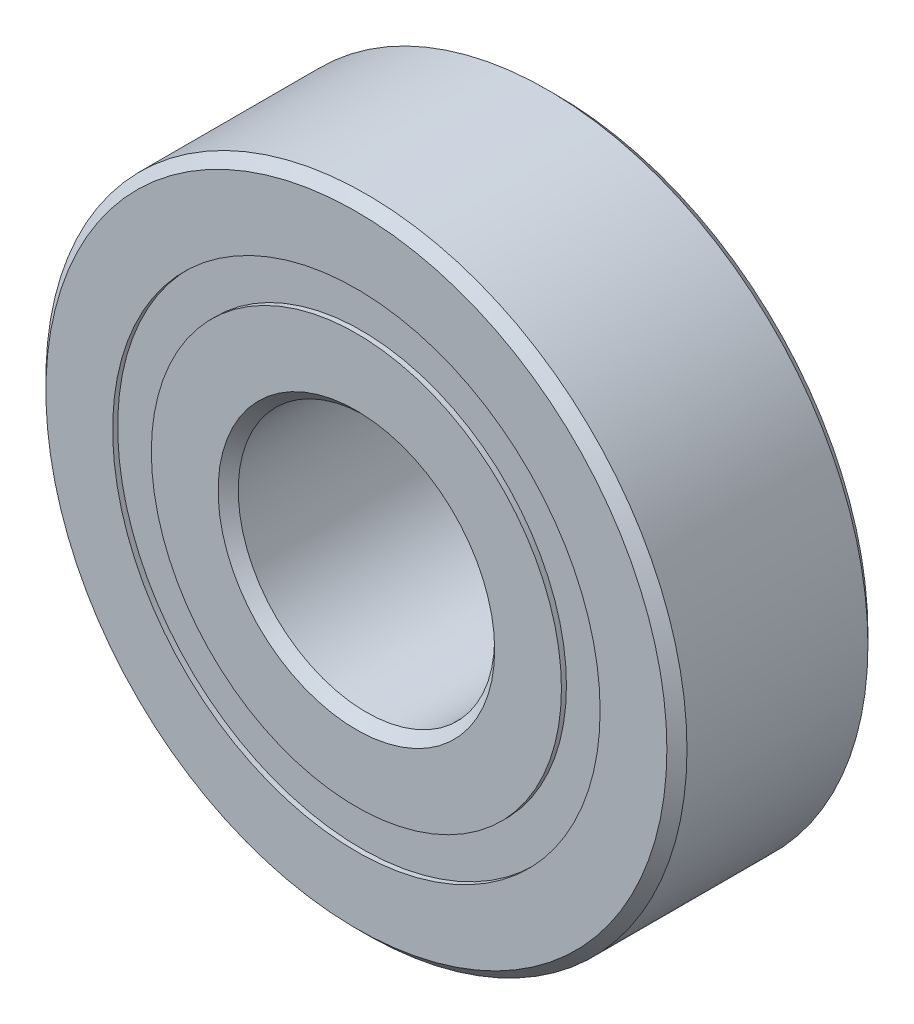
ISO-10303-21;
HEADER;
FILE_DESCRIPTION(('STEP AP214'),'2;1');
FILE_NAME('part.step','',(''),(''),'','','');
FILE_SCHEMA(('AUTOMOTIVE_DESIGN { 1 0 10303 214 1 1 1 1 }'));
ENDSEC;
DATA;
#1=APPLICATION_CONTEXT('core data for automotive mechanical design processes');
#2=APPLICATION_PROTOCOL_DEFINITION('international standard','automotive_design',2000,#1);
#3=PRODUCT_CONTEXT('',#1,'mechanical');
#4=PRODUCT('Part','Part','',(#3));
#5=PRODUCT_RELATED_PRODUCT_CATEGORY('part','',(#4));
#6=PRODUCT_DEFINITION_FORMATION('','',#4);
#7=PRODUCT_DEFINITION_CONTEXT('part definition',#1,'design');
#8=PRODUCT_DEFINITION('design','',#6,#7);
#9=PRODUCT_DEFINITION_SHAPE('','',#8);
#10=(LENGTH_UNIT() NAMED_UNIT(*) SI_UNIT(.MILLI.,.METRE.));
#11=(NAMED_UNIT(*) PLANE_ANGLE_UNIT() SI_UNIT($,.RADIAN.));
#12=(NAMED_UNIT(*) SI_UNIT($,.STERADIAN.) SOLID_ANGLE_UNIT());
#13=UNCERTAINTY_MEASURE_WITH_UNIT(LENGTH_MEASURE(1.E-05),#10,'distance_accuracy_value','');
#14=(GEOMETRIC_REPRESENTATION_CONTEXT(3) GLOBAL_UNCERTAINTY_ASSIGNED_CONTEXT((#13)) GLOBAL_UNIT_ASSIGNED_CONTEXT((#10,
#11,#12)) REPRESENTATION_CONTEXT('',''));
#15=CARTESIAN_POINT('',(0.,0.,0.));
#16=DIRECTION('',(0.,0.,1.));
#17=DIRECTION('',(1.,0.,0.));
#18=AXIS2_PLACEMENT_3D('',#15,#16,#17);
#19=CARTESIAN_POINT('',(0.,6.03522142857143,-2.36474));
#20=DIRECTION('',(0.,0.,1.));
#21=DIRECTION('',(1.,0.,0.));
#22=AXIS2_PLACEMENT_3D('',#19,#20,#21);
#23=PLANE('',#22);
#24=CARTESIAN_POINT('',(0.,0.,-2.36474));
#25=DIRECTION('',(0.,0.,1.));
#26=DIRECTION('',(1.,0.,0.));
#27=AXIS2_PLACEMENT_3D('',#24,#25,#26);
#28=CIRCLE('',#27,6.03522142857143);
#29=CARTESIAN_POINT('',(6.03522142857143,0.,-2.36474));
#30=VERTEX_POINT('',#29);
#31=EDGE_CURVE('E72',#30,#30,#28,.T.);
#32=ORIENTED_EDGE('',*,*,#31,.F.);
#33=EDGE_LOOP('',(#32));
#34=FACE_BOUND('',#33,.T.);
#35=CARTESIAN_POINT('',(0.,0.,-2.36474));
#36=DIRECTION('',(0.,0.,1.));
#37=DIRECTION('',(1.,0.,0.));
#38=AXIS2_PLACEMENT_3D('',#35,#36,#37);
#39=CIRCLE('',#38,5.07727857142857);
#40=CARTESIAN_POINT('',(5.07727857142857,0.,-2.36474));
#41=VERTEX_POINT('',#40);
#42=EDGE_CURVE('E11',#41,#41,#39,.T.);
#43=ORIENTED_EDGE('',*,*,#42,.T.);
#44=EDGE_LOOP('',(#43));
#45=FACE_BOUND('',#44,.T.);
#46=ADVANCED_FACE('F58',(#34,#45),#23,.F.);
#47=CARTESIAN_POINT('',(0.,0.,2.4892));
#48=DIRECTION('',(0.,0.,1.));
#49=DIRECTION('',(1.,0.,0.));
#50=AXIS2_PLACEMENT_3D('',#47,#48,#49);
#51=CYLINDRICAL_SURFACE('',#50,5.07727857142857);
#52=ORIENTED_EDGE('',*,*,#42,.F.);
#53=EDGE_LOOP('',(#52));
#54=FACE_BOUND('',#53,.T.);
#55=CARTESIAN_POINT('',(0.,0.,-1.20554465033679));
#56=DIRECTION('',(0.,0.,1.));
#57=DIRECTION('',(1.,0.,0.));
#58=AXIS2_PLACEMENT_3D('',#55,#56,#57);
#59=CIRCLE('',#58,5.07727857142857);
#60=CARTESIAN_POINT('',(5.07727857142857,0.,-1.20554465033679));
#61=VERTEX_POINT('',#60);
#62=EDGE_CURVE('E64',#61,#61,#59,.T.);
#63=ORIENTED_EDGE('',*,*,#62,.T.);
#64=EDGE_LOOP('',(#63));
#65=FACE_BOUND('',#64,.T.);
#66=ADVANCED_FACE('F81',(#54,#65),#51,.F.);
#67=CARTESIAN_POINT('',(0.,6.03522142857143,-1.20554465033679));
#68=DIRECTION('',(0.,0.,-1.));
#69=DIRECTION('',(-1.,0.,0.));
#70=AXIS2_PLACEMENT_3D('',#67,#68,#69);
#71=PLANE('',#70);
#72=ORIENTED_EDGE('',*,*,#62,.F.);
#73=EDGE_LOOP('',(#72));
#74=FACE_BOUND('',#73,.T.);
#75=CARTESIAN_POINT('',(0.,0.,-1.20554465033679));
#76=DIRECTION('',(0.,0.,1.));
#77=DIRECTION('',(1.,0.,0.));
#78=AXIS2_PLACEMENT_3D('',#75,#76,#77);
#79=CIRCLE('',#78,6.03522142857143);
#80=CARTESIAN_POINT('',(6.03522142857143,0.,-1.20554465033679));
#81=VERTEX_POINT('',#80);
#82=EDGE_CURVE('E68',#81,#81,#79,.T.);
#83=ORIENTED_EDGE('',*,*,#82,.T.);
#84=EDGE_LOOP('',(#83));
#85=FACE_BOUND('',#84,.T.);
#86=ADVANCED_FACE('F85',(#74,#85),#71,.F.);
#87=CARTESIAN_POINT('',(0.,0.,2.4892));
#88=DIRECTION('',(0.,0.,1.));
#89=DIRECTION('',(1.,0.,0.));
#90=AXIS2_PLACEMENT_3D('',#87,#88,#89);
#91=CYLINDRICAL_SURFACE('',#90,6.03522142857143);
#92=ORIENTED_EDGE('',*,*,#82,.F.);
#93=EDGE_LOOP('',(#92));
#94=FACE_BOUND('',#93,.T.);
#95=ORIENTED_EDGE('',*,*,#31,.T.);
#96=EDGE_LOOP('',(#95));
#97=FACE_BOUND('',#96,.T.);
#98=ADVANCED_FACE('F78',(#94,#97),#91,.T.);
#99=CLOSED_SHELL('',(#46,#66,#86,#98));
#100=MANIFOLD_SOLID_BREP('B2',#99);
#101=CARTESIAN_POINT('',(0.,6.03522142857143,2.36474));
#102=DIRECTION('',(0.,0.,-1.));
#103=DIRECTION('',(-1.,0.,0.));
#104=AXIS2_PLACEMENT_3D('',#101,#102,#103);
#105=PLANE('',#104);
#106=CARTESIAN_POINT('',(0.,0.,2.36474));
#107=DIRECTION('',(0.,0.,1.));
#108=DIRECTION('',(1.,0.,0.));
#109=AXIS2_PLACEMENT_3D('',#106,#107,#108);
#110=CIRCLE('',#109,5.07727857142857);
#111=CARTESIAN_POINT('',(5.07727857142857,0.,2.36474));
#112=VERTEX_POINT('',#111);
#113=EDGE_CURVE('E57',#112,#112,#110,.T.);
#114=ORIENTED_EDGE('',*,*,#113,.F.);
#115=EDGE_LOOP('',(#114));
#116=FACE_BOUND('',#115,.T.);
#117=CARTESIAN_POINT('',(0.,0.,2.36474));
#118=DIRECTION('',(0.,0.,1.));
#119=DIRECTION('',(1.,0.,0.));
#120=AXIS2_PLACEMENT_3D('',#117,#118,#119);
#121=CIRCLE('',#120,6.03522142857143);
#122=CARTESIAN_POINT('',(6.03522142857143,0.,2.36474));
#123=VERTEX_POINT('',#122);
#124=EDGE_CURVE('E159',#123,#123,#121,.T.);
#125=ORIENTED_EDGE('',*,*,#124,.T.);
#126=EDGE_LOOP('',(#125));
#127=FACE_BOUND('',#126,.T.);
#128=ADVANCED_FACE('F145',(#116,#127),#105,.F.);
#129=CARTESIAN_POINT('',(0.,0.,2.4892));
#130=DIRECTION('',(0.,0.,1.));
#131=DIRECTION('',(1.,0.,0.));
#132=AXIS2_PLACEMENT_3D('',#129,#130,#131);
#133=CYLINDRICAL_SURFACE('',#132,5.07727857142857);
#134=CARTESIAN_POINT('',(0.,0.,1.20554465033679));
#135=DIRECTION('',(0.,0.,1.));
#136=DIRECTION('',(1.,0.,0.));
#137=AXIS2_PLACEMENT_3D('',#134,#135,#136);
#138=CIRCLE('',#137,5.07727857142857);
#139=CARTESIAN_POINT('',(5.07727857142857,0.,1.20554465033679));
#140=VERTEX_POINT('',#139);
#141=EDGE_CURVE('E151',#140,#140,#138,.T.);
#142=ORIENTED_EDGE('',*,*,#141,.F.);
#143=EDGE_LOOP('',(#142));
#144=FACE_BOUND('',#143,.T.);
#145=ORIENTED_EDGE('',*,*,#113,.T.);
#146=EDGE_LOOP('',(#145));
#147=FACE_BOUND('',#146,.T.);
#148=ADVANCED_FACE('F174',(#144,#147),#133,.F.);
#149=CARTESIAN_POINT('',(0.,6.03522142857143,1.20554465033679));
#150=DIRECTION('',(0.,0.,1.));
#151=DIRECTION('',(1.,0.,0.));
#152=AXIS2_PLACEMENT_3D('',#149,#150,#151);
#153=PLANE('',#152);
#154=CARTESIAN_POINT('',(0.,0.,1.20554465033679));
#155=DIRECTION('',(0.,0.,1.));
#156=DIRECTION('',(1.,0.,0.));
#157=AXIS2_PLACEMENT_3D('',#154,#155,#156);
#158=CIRCLE('',#157,6.03522142857143);
#159=CARTESIAN_POINT('',(6.03522142857143,0.,1.20554465033679));
#160=VERTEX_POINT('',#159);
#161=EDGE_CURVE('E155',#160,#160,#158,.T.);
#162=ORIENTED_EDGE('',*,*,#161,.F.);
#163=EDGE_LOOP('',(#162));
#164=FACE_BOUND('',#163,.T.);
#165=ORIENTED_EDGE('',*,*,#141,.T.);
#166=EDGE_LOOP('',(#165));
#167=FACE_BOUND('',#166,.T.);
#168=ADVANCED_FACE('F169',(#164,#167),#153,.F.);
#169=CARTESIAN_POINT('',(0.,0.,2.4892));
#170=DIRECTION('',(0.,0.,1.));
#171=DIRECTION('',(1.,0.,0.));
#172=AXIS2_PLACEMENT_3D('',#169,#170,#171);
#173=CYLINDRICAL_SURFACE('',#172,6.03522142857143);
#174=ORIENTED_EDGE('',*,*,#124,.F.);
#175=EDGE_LOOP('',(#174));
#176=FACE_BOUND('',#175,.T.);
#177=ORIENTED_EDGE('',*,*,#161,.T.);
#178=EDGE_LOOP('',(#177));
#179=FACE_BOUND('',#178,.T.);
#180=ADVANCED_FACE('F166',(#176,#179),#173,.T.);
#181=CLOSED_SHELL('',(#128,#148,#168,#180));
#182=MANIFOLD_SOLID_BREP('B6',#181);
#183=CARTESIAN_POINT('',(-3.26588180805,4.49510067499584,0.));
#184=DIRECTION('',(0.,0.,1.));
#185=DIRECTION('',(-0.587785252292462,0.809016994374955,0.));
#186=AXIS2_PLACEMENT_3D('',#183,#184,#185);
#187=SPHERICAL_SURFACE('',#186,1.20554465033679);
#188=CARTESIAN_POINT('',(-3.26588180805,4.49510067499584,1.20554465033679));
#189=VERTEX_POINT('',#188);
#190=VERTEX_LOOP('',#189);
#191=FACE_BOUND('',#190,.T.);
#192=ADVANCED_FACE('F232',(#191),#187,.T.);
#193=CLOSED_SHELL('',(#192));
#194=MANIFOLD_SOLID_BREP('B52',#193);
#195=CARTESIAN_POINT('',(-5.28430776866493,1.71697567499586,0.));
#196=DIRECTION('',(0.,0.,1.));
#197=DIRECTION('',(-0.95105651629515,0.309016994374958,0.));
#198=AXIS2_PLACEMENT_3D('',#195,#196,#197);
#199=SPHERICAL_SURFACE('',#198,1.20554465033679);
#200=CARTESIAN_POINT('',(-5.28430776866493,1.71697567499586,1.20554465033679));
#201=VERTEX_POINT('',#200);
#202=VERTEX_LOOP('',#201);
#203=FACE_BOUND('',#202,.T.);
#204=ADVANCED_FACE('F255',(#203),#199,.T.);
#205=CLOSED_SHELL('',(#204));
#206=MANIFOLD_SOLID_BREP('B141',#205);
#207=CARTESIAN_POINT('',(-5.28430776866496,-1.71697567499575,0.));
#208=DIRECTION('',(0.,0.,1.));
#209=DIRECTION('',(-0.951056516295157,-0.309016994374938,0.));
#210=AXIS2_PLACEMENT_3D('',#207,#208,#209);
#211=SPHERICAL_SURFACE('',#210,1.20554465033679);
#212=CARTESIAN_POINT('',(-5.28430776866496,-1.71697567499575,1.20554465033679));
#213=VERTEX_POINT('',#212);
#214=VERTEX_LOOP('',#213);
#215=FACE_BOUND('',#214,.T.);
#216=ADVANCED_FACE('F278',(#215),#211,.T.);
#217=CLOSED_SHELL('',(#216));
#218=MANIFOLD_SOLID_BREP('B228',#217);
#219=CARTESIAN_POINT('',(-3.26588180805009,-4.49510067499577,0.));
#220=DIRECTION('',(0.,0.,1.));
#221=DIRECTION('',(-0.58778525229248,-0.809016994374942,0.));
#222=AXIS2_PLACEMENT_3D('',#219,#220,#221);
#223=SPHERICAL_SURFACE('',#222,1.20554465033679);
#224=CARTESIAN_POINT('',(-3.26588180805009,-4.49510067499577,1.20554465033679));
#225=VERTEX_POINT('',#224);
#226=VERTEX_LOOP('',#225);
#227=FACE_BOUND('',#226,.T.);
#228=ADVANCED_FACE('F301',(#227),#223,.T.);
#229=CLOSED_SHELL('',(#228));
#230=MANIFOLD_SOLID_BREP('B251',#229);
#231=CARTESIAN_POINT('',(0.,-5.55625,0.));
#232=DIRECTION('',(0.,0.,1.));
#233=DIRECTION('',(0.,-1.,0.));
#234=AXIS2_PLACEMENT_3D('',#231,#232,#233);
#235=SPHERICAL_SURFACE('',#234,1.20554465033679);
#236=CARTESIAN_POINT('',(0.,-5.55625,1.20554465033679));
#237=VERTEX_POINT('',#236);
#238=VERTEX_LOOP('',#237);
#239=FACE_BOUND('',#238,.T.);
#240=ADVANCED_FACE('F324',(#239),#235,.T.);
#241=CLOSED_SHELL('',(#240));
#242=MANIFOLD_SOLID_BREP('B274',#241);
#243=CARTESIAN_POINT('',(3.26588180805003,-4.49510067499582,0.));
#244=DIRECTION('',(0.,0.,1.));
#245=DIRECTION('',(0.587785252292469,-0.809016994374951,0.));
#246=AXIS2_PLACEMENT_3D('',#243,#244,#245);
#247=SPHERICAL_SURFACE('',#246,1.20554465033679);
#248=CARTESIAN_POINT('',(3.26588180805003,-4.49510067499582,1.20554465033679));
#249=VERTEX_POINT('',#248);
#250=VERTEX_LOOP('',#249);
#251=FACE_BOUND('',#250,.T.);
#252=ADVANCED_FACE('F347',(#251),#247,.T.);
#253=CLOSED_SHELL('',(#252));
#254=MANIFOLD_SOLID_BREP('B297',#253);
#255=CARTESIAN_POINT('',(5.28430776866494,-1.71697567499582,0.));
#256=DIRECTION('',(0.,0.,1.));
#257=DIRECTION('',(0.951056516295152,-0.309016994374952,0.));
#258=AXIS2_PLACEMENT_3D('',#255,#256,#257);
#259=SPHERICAL_SURFACE('',#258,1.20554465033679);
#260=CARTESIAN_POINT('',(5.28430776866494,-1.71697567499582,1.20554465033679));
#261=VERTEX_POINT('',#260);
#262=VERTEX_LOOP('',#261);
#263=FACE_BOUND('',#262,.T.);
#264=ADVANCED_FACE('F370',(#263),#259,.T.);
#265=CLOSED_SHELL('',(#264));
#266=MANIFOLD_SOLID_BREP('B320',#265);
#267=CARTESIAN_POINT('',(5.28430776866495,1.71697567499579,0.));
#268=DIRECTION('',(0.,0.,1.));
#269=DIRECTION('',(0.951056516295155,0.309016994374945,0.));
#270=AXIS2_PLACEMENT_3D('',#267,#268,#269);
#271=SPHERICAL_SURFACE('',#270,1.20554465033679);
#272=CARTESIAN_POINT('',(5.28430776866495,1.71697567499579,1.20554465033679));
#273=VERTEX_POINT('',#272);
#274=VERTEX_LOOP('',#273);
#275=FACE_BOUND('',#274,.T.);
#276=ADVANCED_FACE('F393',(#275),#271,.T.);
#277=CLOSED_SHELL('',(#276));
#278=MANIFOLD_SOLID_BREP('B343',#277);
#279=CARTESIAN_POINT('',(3.26588180805006,4.4951006749958,0.));
#280=DIRECTION('',(0.,0.,1.));
#281=DIRECTION('',(0.587785252292474,0.809016994374947,0.));
#282=AXIS2_PLACEMENT_3D('',#279,#280,#281);
#283=SPHERICAL_SURFACE('',#282,1.20554465033679);
#284=CARTESIAN_POINT('',(3.26588180805006,4.4951006749958,1.20554465033679));
#285=VERTEX_POINT('',#284);
#286=VERTEX_LOOP('',#285);
#287=FACE_BOUND('',#286,.T.);
#288=ADVANCED_FACE('F416',(#287),#283,.T.);
#289=CLOSED_SHELL('',(#288));
#290=MANIFOLD_SOLID_BREP('B366',#289);
#291=CARTESIAN_POINT('',(0.,5.55625,0.));
#292=DIRECTION('',(0.,0.,1.));
#293=DIRECTION('',(0.,1.,0.));
#294=AXIS2_PLACEMENT_3D('',#291,#292,#293);
#295=SPHERICAL_SURFACE('',#294,1.20554465033679);
#296=CARTESIAN_POINT('',(0.,5.55625,1.20554465033679));
#297=VERTEX_POINT('',#296);
#298=VERTEX_LOOP('',#297);
#299=FACE_BOUND('',#298,.T.);
#300=ADVANCED_FACE('F441',(#299),#295,.T.);
#301=CLOSED_SHELL('',(#300));
#302=MANIFOLD_SOLID_BREP('B389',#301);
#303=CARTESIAN_POINT('',(0.,5.07727857142857,2.4892));
#304=DIRECTION('',(0.,0.,-1.));
#305=DIRECTION('',(-1.,0.,0.));
#306=AXIS2_PLACEMENT_3D('',#303,#304,#305);
#307=PLANE('',#306);
#308=CARTESIAN_POINT('',(0.,0.,2.4892));
#309=DIRECTION('',(0.,0.,1.));
#310=DIRECTION('',(1.,0.,0.));
#311=AXIS2_PLACEMENT_3D('',#308,#309,#310);
#312=CIRCLE('',#311,3.42392);
#313=CARTESIAN_POINT('',(3.42392,0.,2.4892));
#314=VERTEX_POINT('',#313);
#315=EDGE_CURVE('E487',#314,#314,#312,.T.);
#316=ORIENTED_EDGE('',*,*,#315,.F.);
#317=EDGE_LOOP('',(#316));
#318=FACE_BOUND('',#317,.T.);
#319=CARTESIAN_POINT('',(0.,0.,2.4892));
#320=DIRECTION('',(0.,0.,1.));
#321=DIRECTION('',(1.,0.,0.));
#322=AXIS2_PLACEMENT_3D('',#319,#320,#321);
#323=CIRCLE('',#322,5.07727857142857);
#324=CARTESIAN_POINT('',(5.07727857142857,0.,2.4892));
#325=VERTEX_POINT('',#324);
#326=EDGE_CURVE('E440',#325,#325,#323,.T.);
#327=ORIENTED_EDGE('',*,*,#326,.T.);
#328=EDGE_LOOP('',(#327));
#329=FACE_BOUND('',#328,.T.);
#330=ADVANCED_FACE('F459',(#318,#329),#307,.F.);
#331=CARTESIAN_POINT('',(0.,0.,2.4892));
#332=DIRECTION('',(0.,0.,1.));
#333=DIRECTION('',(1.,0.,0.));
#334=AXIS2_PLACEMENT_3D('',#331,#332,#333);
#335=CYLINDRICAL_SURFACE('',#334,5.07727857142857);
#336=ORIENTED_EDGE('',*,*,#326,.F.);
#337=EDGE_LOOP('',(#336));
#338=FACE_BOUND('',#337,.T.);
#339=CARTESIAN_POINT('',(0.,0.,1.10631111111111));
#340=DIRECTION('',(0.,0.,1.));
#341=DIRECTION('',(1.,0.,0.));
#342=AXIS2_PLACEMENT_3D('',#339,#340,#341);
#343=CIRCLE('',#342,5.07727857142857);
#344=CARTESIAN_POINT('',(5.07727857142857,0.,1.10631111111111));
#345=VERTEX_POINT('',#344);
#346=EDGE_CURVE('E465',#345,#345,#343,.T.);
#347=ORIENTED_EDGE('',*,*,#346,.T.);
#348=EDGE_LOOP('',(#347));
#349=FACE_BOUND('',#348,.T.);
#350=ADVANCED_FACE('F494',(#338,#349),#335,.T.);
#351=CARTESIAN_POINT('',(0.,0.,0.));
#352=DIRECTION('',(0.,0.,1.));
#353=DIRECTION('',(1.,0.,0.));
#354=AXIS2_PLACEMENT_3D('',#351,#352,#353);
#355=TOROIDAL_SURFACE('',#354,5.55625,1.20554465033679);
#356=ORIENTED_EDGE('',*,*,#346,.F.);
#357=EDGE_LOOP('',(#356));
#358=FACE_BOUND('',#357,.T.);
#359=CARTESIAN_POINT('',(0.,0.,-1.10631111111111));
#360=DIRECTION('',(0.,0.,1.));
#361=DIRECTION('',(1.,0.,0.));
#362=AXIS2_PLACEMENT_3D('',#359,#360,#361);
#363=CIRCLE('',#362,5.07727857142857);
#364=CARTESIAN_POINT('',(5.07727857142857,0.,-1.10631111111111));
#365=VERTEX_POINT('',#364);
#366=EDGE_CURVE('E469',#365,#365,#363,.T.);
#367=ORIENTED_EDGE('',*,*,#366,.T.);
#368=EDGE_LOOP('',(#367));
#369=FACE_BOUND('',#368,.T.);
#370=ADVANCED_FACE('F498',(#358,#369),#355,.F.);
#371=CARTESIAN_POINT('',(0.,0.,2.4892));
#372=DIRECTION('',(0.,0.,1.));
#373=DIRECTION('',(1.,0.,0.));
#374=AXIS2_PLACEMENT_3D('',#371,#372,#373);
#375=CYLINDRICAL_SURFACE('',#374,5.07727857142857);
#376=ORIENTED_EDGE('',*,*,#366,.F.);
#377=EDGE_LOOP('',(#376));
#378=FACE_BOUND('',#377,.T.);
#379=CARTESIAN_POINT('',(0.,0.,-2.4892));
#380=DIRECTION('',(0.,0.,1.));
#381=DIRECTION('',(1.,0.,0.));
#382=AXIS2_PLACEMENT_3D('',#379,#380,#381);
#383=CIRCLE('',#382,5.07727857142857);
#384=CARTESIAN_POINT('',(5.07727857142857,0.,-2.4892));
#385=VERTEX_POINT('',#384);
#386=EDGE_CURVE('E473',#385,#385,#383,.T.);
#387=ORIENTED_EDGE('',*,*,#386,.T.);
#388=EDGE_LOOP('',(#387));
#389=FACE_BOUND('',#388,.T.);
#390=ADVANCED_FACE('F503',(#378,#389),#375,.T.);
#391=CARTESIAN_POINT('',(0.,3.42392,-2.4892));
#392=DIRECTION('',(0.,0.,1.));
#393=DIRECTION('',(1.,0.,0.));
#394=AXIS2_PLACEMENT_3D('',#391,#392,#393);
#395=PLANE('',#394);
#396=ORIENTED_EDGE('',*,*,#386,.F.);
#397=EDGE_LOOP('',(#396));
#398=FACE_BOUND('',#397,.T.);
#399=CARTESIAN_POINT('',(0.,0.,-2.4892));
#400=DIRECTION('',(0.,0.,1.));
#401=DIRECTION('',(1.,0.,0.));
#402=AXIS2_PLACEMENT_3D('',#399,#400,#401);
#403=CIRCLE('',#402,3.42392);
#404=CARTESIAN_POINT('',(3.42392,0.,-2.4892));
#405=VERTEX_POINT('',#404);
#406=EDGE_CURVE('E478',#405,#405,#403,.T.);
#407=ORIENTED_EDGE('',*,*,#406,.T.);
#408=EDGE_LOOP('',(#407));
#409=FACE_BOUND('',#408,.T.);
#410=ADVANCED_FACE('F509',(#398,#409),#395,.F.);
#411=CARTESIAN_POINT('',(0.,0.,-2.24028));
#412=DIRECTION('',(0.,0.,-1.));
#413=DIRECTION('',(-1.,0.,0.));
#414=AXIS2_PLACEMENT_3D('',#411,#412,#413);
#415=CONICAL_SURFACE('',#414,3.175,0.785398163397446);
#416=ORIENTED_EDGE('',*,*,#406,.F.);
#417=EDGE_LOOP('',(#416));
#418=FACE_BOUND('',#417,.T.);
#419=CARTESIAN_POINT('',(0.,0.,-2.24028));
#420=DIRECTION('',(0.,0.,1.));
#421=DIRECTION('',(1.,0.,0.));
#422=AXIS2_PLACEMENT_3D('',#419,#420,#421);
#423=CIRCLE('',#422,3.175);
#424=CARTESIAN_POINT('',(3.175,0.,-2.24028));
#425=VERTEX_POINT('',#424);
#426=EDGE_CURVE('E481',#425,#425,#423,.T.);
#427=ORIENTED_EDGE('',*,*,#426,.T.);
#428=EDGE_LOOP('',(#427));
#429=FACE_BOUND('',#428,.T.);
#430=ADVANCED_FACE('F512',(#418,#429),#415,.F.);
#431=CARTESIAN_POINT('',(0.,0.,2.4892));
#432=DIRECTION('',(0.,0.,1.));
#433=DIRECTION('',(1.,0.,0.));
#434=AXIS2_PLACEMENT_3D('',#431,#432,#433);
#435=CYLINDRICAL_SURFACE('',#434,3.175);
#436=ORIENTED_EDGE('',*,*,#426,.F.);
#437=EDGE_LOOP('',(#436));
#438=FACE_BOUND('',#437,.T.);
#439=CARTESIAN_POINT('',(0.,0.,2.24028));
#440=DIRECTION('',(0.,0.,1.));
#441=DIRECTION('',(1.,0.,0.));
#442=AXIS2_PLACEMENT_3D('',#439,#440,#441);
#443=CIRCLE('',#442,3.175);
#444=CARTESIAN_POINT('',(3.175,0.,2.24028));
#445=VERTEX_POINT('',#444);
#446=EDGE_CURVE('E484',#445,#445,#443,.T.);
#447=ORIENTED_EDGE('',*,*,#446,.T.);
#448=EDGE_LOOP('',(#447));
#449=FACE_BOUND('',#448,.T.);
#450=ADVANCED_FACE('F516',(#438,#449),#435,.F.);
#451=CARTESIAN_POINT('',(0.,0.,2.4892));
#452=DIRECTION('',(0.,0.,1.));
#453=DIRECTION('',(1.,0.,0.));
#454=AXIS2_PLACEMENT_3D('',#451,#452,#453);
#455=CONICAL_SURFACE('',#454,3.42392,0.785398163397449);
#456=ORIENTED_EDGE('',*,*,#446,.F.);
#457=EDGE_LOOP('',(#456));
#458=FACE_BOUND('',#457,.T.);
#459=ORIENTED_EDGE('',*,*,#315,.T.);
#460=EDGE_LOOP('',(#459));
#461=FACE_BOUND('',#460,.T.);
#462=ADVANCED_FACE('F491',(#458,#461),#455,.F.);
#463=CLOSED_SHELL('',(#330,#350,#370,#390,#410,#430,#450,#462));
#464=MANIFOLD_SOLID_BREP('B412',#463);
#465=CARTESIAN_POINT('',(0.,0.,2.24028));
#466=DIRECTION('',(0.,0.,-1.));
#467=DIRECTION('',(-1.,0.,0.));
#468=AXIS2_PLACEMENT_3D('',#465,#466,#467);
#469=CONICAL_SURFACE('',#468,7.9375,0.785398163397446);
#470=CARTESIAN_POINT('',(0.,0.,2.4892));
#471=DIRECTION('',(0.,0.,1.));
#472=DIRECTION('',(1.,0.,0.));
#473=AXIS2_PLACEMENT_3D('',#470,#471,#472);
#474=CIRCLE('',#473,7.68858);
#475=CARTESIAN_POINT('',(7.68858,0.,2.4892));
#476=VERTEX_POINT('',#475);
#477=EDGE_CURVE('E598',#476,#476,#474,.T.);
#478=ORIENTED_EDGE('',*,*,#477,.F.);
#479=EDGE_LOOP('',(#478));
#480=FACE_BOUND('',#479,.T.);
#481=CARTESIAN_POINT('',(0.,0.,2.24028));
#482=DIRECTION('',(0.,0.,1.));
#483=DIRECTION('',(1.,0.,0.));
#484=AXIS2_PLACEMENT_3D('',#481,#482,#483);
#485=CIRCLE('',#484,7.9375);
#486=CARTESIAN_POINT('',(7.9375,0.,2.24028));
#487=VERTEX_POINT('',#486);
#488=EDGE_CURVE('E458',#487,#487,#485,.T.);
#489=ORIENTED_EDGE('',*,*,#488,.T.);
#490=EDGE_LOOP('',(#489));
#491=FACE_BOUND('',#490,.T.);
#492=ADVANCED_FACE('F570',(#480,#491),#469,.T.);
#493=CARTESIAN_POINT('',(0.,0.,2.4892));
#494=DIRECTION('',(0.,0.,1.));
#495=DIRECTION('',(1.,0.,0.));
#496=AXIS2_PLACEMENT_3D('',#493,#494,#495);
#497=CYLINDRICAL_SURFACE('',#496,7.9375);
#498=ORIENTED_EDGE('',*,*,#488,.F.);
#499=EDGE_LOOP('',(#498));
#500=FACE_BOUND('',#499,.T.);
#501=CARTESIAN_POINT('',(0.,0.,-2.24028));
#502=DIRECTION('',(0.,0.,1.));
#503=DIRECTION('',(1.,0.,0.));
#504=AXIS2_PLACEMENT_3D('',#501,#502,#503);
#505=CIRCLE('',#504,7.9375);
#506=CARTESIAN_POINT('',(7.9375,0.,-2.24028));
#507=VERTEX_POINT('',#506);
#508=EDGE_CURVE('E576',#507,#507,#505,.T.);
#509=ORIENTED_EDGE('',*,*,#508,.T.);
#510=EDGE_LOOP('',(#509));
#511=FACE_BOUND('',#510,.T.);
#512=ADVANCED_FACE('F605',(#500,#511),#497,.T.);
#513=CARTESIAN_POINT('',(0.,0.,-2.4892));
#514=DIRECTION('',(0.,0.,1.));
#515=DIRECTION('',(1.,0.,0.));
#516=AXIS2_PLACEMENT_3D('',#513,#514,#515);
#517=CONICAL_SURFACE('',#516,7.68858,0.785398163397445);
#518=ORIENTED_EDGE('',*,*,#508,.F.);
#519=EDGE_LOOP('',(#518));
#520=FACE_BOUND('',#519,.T.);
#521=CARTESIAN_POINT('',(0.,0.,-2.4892));
#522=DIRECTION('',(0.,0.,1.));
#523=DIRECTION('',(1.,0.,0.));
#524=AXIS2_PLACEMENT_3D('',#521,#522,#523);
#525=CIRCLE('',#524,7.68858);
#526=CARTESIAN_POINT('',(7.68858,0.,-2.4892));
#527=VERTEX_POINT('',#526);
#528=EDGE_CURVE('E580',#527,#527,#525,.T.);
#529=ORIENTED_EDGE('',*,*,#528,.T.);
#530=EDGE_LOOP('',(#529));
#531=FACE_BOUND('',#530,.T.);
#532=ADVANCED_FACE('F609',(#520,#531),#517,.T.);
#533=CARTESIAN_POINT('',(0.,7.68858,-2.4892));
#534=DIRECTION('',(0.,0.,1.));
#535=DIRECTION('',(1.,0.,0.));
#536=AXIS2_PLACEMENT_3D('',#533,#534,#535);
#537=PLANE('',#536);
#538=ORIENTED_EDGE('',*,*,#528,.F.);
#539=EDGE_LOOP('',(#538));
#540=FACE_BOUND('',#539,.T.);
#541=CARTESIAN_POINT('',(0.,0.,-2.4892));
#542=DIRECTION('',(0.,0.,1.));
#543=DIRECTION('',(1.,0.,0.));
#544=AXIS2_PLACEMENT_3D('',#541,#542,#543);
#545=CIRCLE('',#544,6.03522142857143);
#546=CARTESIAN_POINT('',(6.03522142857143,0.,-2.4892));
#547=VERTEX_POINT('',#546);
#548=EDGE_CURVE('E584',#547,#547,#545,.T.);
#549=ORIENTED_EDGE('',*,*,#548,.T.);
#550=EDGE_LOOP('',(#549));
#551=FACE_BOUND('',#550,.T.);
#552=ADVANCED_FACE('F614',(#540,#551),#537,.F.);
#553=CARTESIAN_POINT('',(0.,0.,2.4892));
#554=DIRECTION('',(0.,0.,1.));
#555=DIRECTION('',(1.,0.,0.));
#556=AXIS2_PLACEMENT_3D('',#553,#554,#555);
#557=CYLINDRICAL_SURFACE('',#556,6.03522142857143);
#558=ORIENTED_EDGE('',*,*,#548,.F.);
#559=EDGE_LOOP('',(#558));
#560=FACE_BOUND('',#559,.T.);
#561=CARTESIAN_POINT('',(0.,0.,-1.10631111111111));
#562=DIRECTION('',(0.,0.,1.));
#563=DIRECTION('',(1.,0.,0.));
#564=AXIS2_PLACEMENT_3D('',#561,#562,#563);
#565=CIRCLE('',#564,6.03522142857143);
#566=CARTESIAN_POINT('',(6.03522142857143,0.,-1.10631111111111));
#567=VERTEX_POINT('',#566);
#568=EDGE_CURVE('E589',#567,#567,#565,.T.);
#569=ORIENTED_EDGE('',*,*,#568,.T.);
#570=EDGE_LOOP('',(#569));
#571=FACE_BOUND('',#570,.T.);
#572=ADVANCED_FACE('F620',(#560,#571),#557,.F.);
#573=CARTESIAN_POINT('',(0.,0.,0.));
#574=DIRECTION('',(0.,0.,1.));
#575=DIRECTION('',(1.,0.,0.));
#576=AXIS2_PLACEMENT_3D('',#573,#574,#575);
#577=TOROIDAL_SURFACE('',#576,5.55625,1.20554465033679);
#578=ORIENTED_EDGE('',*,*,#568,.F.);
#579=EDGE_LOOP('',(#578));
#580=FACE_BOUND('',#579,.T.);
#581=CARTESIAN_POINT('',(0.,0.,1.10631111111111));
#582=DIRECTION('',(0.,0.,1.));
#583=DIRECTION('',(1.,0.,0.));
#584=AXIS2_PLACEMENT_3D('',#581,#582,#583);
#585=CIRCLE('',#584,6.03522142857143);
#586=CARTESIAN_POINT('',(6.03522142857143,0.,1.10631111111111));
#587=VERTEX_POINT('',#586);
#588=EDGE_CURVE('E592',#587,#587,#585,.T.);
#589=ORIENTED_EDGE('',*,*,#588,.T.);
#590=EDGE_LOOP('',(#589));
#591=FACE_BOUND('',#590,.T.);
#592=ADVANCED_FACE('F624',(#580,#591),#577,.F.);
#593=CARTESIAN_POINT('',(0.,0.,2.4892));
#594=DIRECTION('',(0.,0.,1.));
#595=DIRECTION('',(1.,0.,0.));
#596=AXIS2_PLACEMENT_3D('',#593,#594,#595);
#597=CYLINDRICAL_SURFACE('',#596,6.03522142857143);
#598=ORIENTED_EDGE('',*,*,#588,.F.);
#599=EDGE_LOOP('',(#598));
#600=FACE_BOUND('',#599,.T.);
#601=CARTESIAN_POINT('',(0.,0.,2.4892));
#602=DIRECTION('',(0.,0.,1.));
#603=DIRECTION('',(1.,0.,0.));
#604=AXIS2_PLACEMENT_3D('',#601,#602,#603);
#605=CIRCLE('',#604,6.03522142857143);
#606=CARTESIAN_POINT('',(6.03522142857143,0.,2.4892));
#607=VERTEX_POINT('',#606);
#608=EDGE_CURVE('E595',#607,#607,#605,.T.);
#609=ORIENTED_EDGE('',*,*,#608,.T.);
#610=EDGE_LOOP('',(#609));
#611=FACE_BOUND('',#610,.T.);
#612=ADVANCED_FACE('F628',(#600,#611),#597,.F.);
#613=CARTESIAN_POINT('',(0.,7.68858,2.4892));
#614=DIRECTION('',(0.,0.,-1.));
#615=DIRECTION('',(-1.,0.,0.));
#616=AXIS2_PLACEMENT_3D('',#613,#614,#615);
#617=PLANE('',#616);
#618=ORIENTED_EDGE('',*,*,#608,.F.);
#619=EDGE_LOOP('',(#618));
#620=FACE_BOUND('',#619,.T.);
#621=ORIENTED_EDGE('',*,*,#477,.T.);
#622=EDGE_LOOP('',(#621));
#623=FACE_BOUND('',#622,.T.);
#624=ADVANCED_FACE('F602',(#620,#623),#617,.F.);
#625=CLOSED_SHELL('',(#492,#512,#532,#552,#572,#592,#612,#624));
#626=MANIFOLD_SOLID_BREP('B435',#625);
#627=ADVANCED_BREP_SHAPE_REPRESENTATION('',(#18,#100,#182,#194,#206,#218,#230,#242,#254,#266,
#278,#290,#302,#464,#626),#14);
#628=SHAPE_DEFINITION_REPRESENTATION(#9,#627);
ENDSEC;
END-ISO-10303-21;
